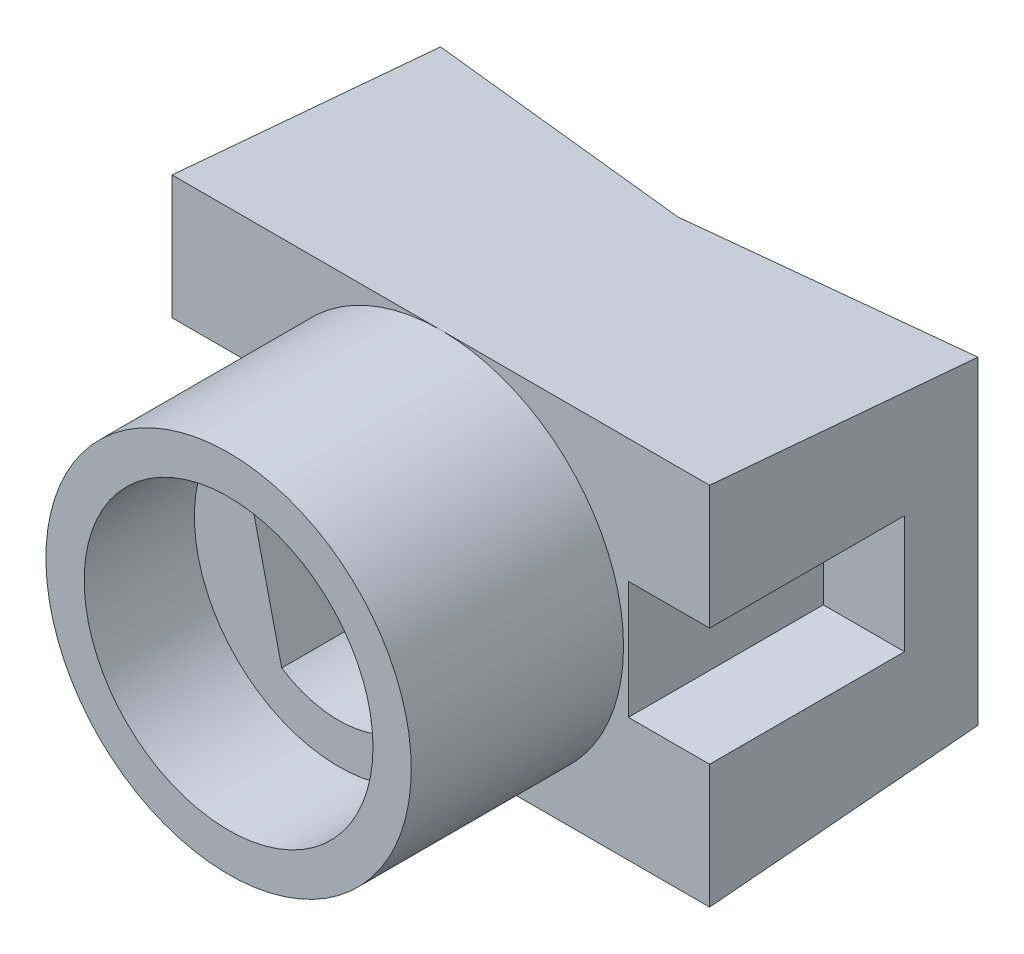
ISO-10303-21;
HEADER;
FILE_DESCRIPTION(('STEP AP214'),'2;1');
FILE_NAME('part.step','',(''),(''),'','','');
FILE_SCHEMA(('AUTOMOTIVE_DESIGN { 1 0 10303 214 1 1 1 1 }'));
ENDSEC;
DATA;
#1=APPLICATION_CONTEXT('core data for automotive mechanical design processes');
#2=APPLICATION_PROTOCOL_DEFINITION('international standard','automotive_design',2000,#1);
#3=PRODUCT_CONTEXT('',#1,'mechanical');
#4=PRODUCT('Part','Part','',(#3));
#5=PRODUCT_RELATED_PRODUCT_CATEGORY('part','',(#4));
#6=PRODUCT_DEFINITION_FORMATION('','',#4);
#7=PRODUCT_DEFINITION_CONTEXT('part definition',#1,'design');
#8=PRODUCT_DEFINITION('design','',#6,#7);
#9=PRODUCT_DEFINITION_SHAPE('','',#8);
#10=(LENGTH_UNIT() NAMED_UNIT(*) SI_UNIT(.MILLI.,.METRE.));
#11=(NAMED_UNIT(*) PLANE_ANGLE_UNIT() SI_UNIT($,.RADIAN.));
#12=(NAMED_UNIT(*) SI_UNIT($,.STERADIAN.) SOLID_ANGLE_UNIT());
#13=UNCERTAINTY_MEASURE_WITH_UNIT(LENGTH_MEASURE(1.E-05),#10,'distance_accuracy_value','');
#14=(GEOMETRIC_REPRESENTATION_CONTEXT(3) GLOBAL_UNCERTAINTY_ASSIGNED_CONTEXT((#13)) GLOBAL_UNIT_ASSIGNED_CONTEXT((#10,
#11,#12)) REPRESENTATION_CONTEXT('',''));
#15=CARTESIAN_POINT('',(0.,0.,0.));
#16=DIRECTION('',(0.,0.,1.));
#17=DIRECTION('',(1.,0.,0.));
#18=AXIS2_PLACEMENT_3D('',#15,#16,#17);
#19=CARTESIAN_POINT('',(0.,0.,4.4));
#20=DIRECTION('',(0.,0.,1.));
#21=DIRECTION('',(1.,0.,0.));
#22=AXIS2_PLACEMENT_3D('',#19,#20,#21);
#23=PLANE('',#22);
#24=CARTESIAN_POINT('',(0.,0.,4.4));
#25=DIRECTION('',(0.,0.,1.));
#26=DIRECTION('',(1.,0.,0.));
#27=AXIS2_PLACEMENT_3D('',#24,#25,#26);
#28=CIRCLE('',#27,6.225);
#29=CARTESIAN_POINT('',(6.22500000000001,0.,4.4));
#30=VERTEX_POINT('',#29);
#31=EDGE_CURVE('E328',#30,#30,#28,.T.);
#32=ORIENTED_EDGE('',*,*,#31,.T.);
#33=EDGE_LOOP('',(#32));
#34=FACE_BOUND('',#33,.T.);
#35=DIRECTION('',(-0.226618541803882,0.973983591499715,0.));
#36=VECTOR('',#35,1.);
#37=CARTESIAN_POINT('',(-3.8707911954993,2.29498922020236,4.4));
#38=LINE('',#37,#36);
#39=CARTESIAN_POINT('',(-2.46010214924883,-3.7680097419276,4.4));
#40=VERTEX_POINT('',#39);
#41=CARTESIAN_POINT('',(-3.8707911954993,2.29498922020236,4.39999999999999));
#42=VERTEX_POINT('',#41);
#43=EDGE_CURVE('E299',#40,#42,#38,.T.);
#44=ORIENTED_EDGE('',*,*,#43,.T.);
#45=CARTESIAN_POINT('',(0.,0.,4.4));
#46=DIRECTION('',(0.,0.,-1.));
#47=DIRECTION('',(-0.973983591499715,-0.226618541803882,0.));
#48=AXIS2_PLACEMENT_3D('',#45,#46,#47);
#49=CIRCLE('',#48,4.5);
#50=CARTESIAN_POINT('',(2.46010214924885,3.7680097419276,4.4));
#51=VERTEX_POINT('',#50);
#52=EDGE_CURVE('E315',#42,#51,#49,.T.);
#53=ORIENTED_EDGE('',*,*,#52,.T.);
#54=DIRECTION('',(0.226618541803882,-0.973983591499715,0.));
#55=VECTOR('',#54,1.);
#56=CARTESIAN_POINT('',(2.46010214924885,3.7680097419276,4.4));
#57=LINE('',#56,#55);
#58=CARTESIAN_POINT('',(3.87079119549931,-2.29498922020236,4.4));
#59=VERTEX_POINT('',#58);
#60=EDGE_CURVE('E310',#51,#59,#57,.T.);
#61=ORIENTED_EDGE('',*,*,#60,.T.);
#62=CARTESIAN_POINT('',(0.,0.,4.4));
#63=DIRECTION('',(0.,0.,-1.));
#64=DIRECTION('',(-0.973983591499715,-0.226618541803882,0.));
#65=AXIS2_PLACEMENT_3D('',#62,#63,#64);
#66=CIRCLE('',#65,4.5);
#67=EDGE_CURVE('E305',#59,#40,#66,.T.);
#68=ORIENTED_EDGE('',*,*,#67,.T.);
#69=EDGE_LOOP('',(#44,#53,#61,#68));
#70=FACE_BOUND('',#69,.T.);
#71=ADVANCED_FACE('F42',(#34,#70),#23,.T.);
#72=CARTESIAN_POINT('',(0.,0.,9.14999999999999));
#73=DIRECTION('',(0.,0.,-1.));
#74=DIRECTION('',(-1.,0.,0.));
#75=AXIS2_PLACEMENT_3D('',#72,#73,#74);
#76=CYLINDRICAL_SURFACE('',#75,7.875);
#77=CARTESIAN_POINT('',(0.,0.,9.14999999999999));
#78=DIRECTION('',(0.,0.,1.));
#79=DIRECTION('',(1.,0.,0.));
#80=AXIS2_PLACEMENT_3D('',#77,#78,#79);
#81=CIRCLE('',#80,7.875);
#82=CARTESIAN_POINT('',(7.875,0.,9.14999999999999));
#83=VERTEX_POINT('',#82);
#84=EDGE_CURVE('E429',#83,#83,#81,.T.);
#85=ORIENTED_EDGE('',*,*,#84,.F.);
#86=EDGE_LOOP('',(#85));
#87=FACE_BOUND('',#86,.T.);
#88=CARTESIAN_POINT('',(0.,0.,0.));
#89=DIRECTION('',(0.,0.,1.));
#90=DIRECTION('',(1.,0.,0.));
#91=AXIS2_PLACEMENT_3D('',#88,#89,#90);
#92=CIRCLE('',#91,7.875);
#93=CARTESIAN_POINT('',(0.046704711715459,-7.87486150163313,0.));
#94=VERTEX_POINT('',#93);
#95=CARTESIAN_POINT('',(0.0467047117159239,7.87486150163312,0.));
#96=VERTEX_POINT('',#95);
#97=EDGE_CURVE('E420',#94,#96,#92,.T.);
#98=ORIENTED_EDGE('',*,*,#97,.T.);
#99=CARTESIAN_POINT('',(0.,0.,-1.36704098327933));
#100=DIRECTION('',(0.,-0.171037543587131,0.985264512039117));
#101=DIRECTION('',(0.,-0.985264512039118,-0.171037543587131));
#102=AXIS2_PLACEMENT_3D('',#99,#100,#101);
#103=ELLIPSE('',#102,7.99277747627567,7.875);
#104=CARTESIAN_POINT('',(-0.046704711716021,7.87486150163313,0.));
#105=VERTEX_POINT('',#104);
#106=EDGE_CURVE('E241',#96,#105,#103,.T.);
#107=ORIENTED_EDGE('',*,*,#106,.T.);
#108=CARTESIAN_POINT('',(-0.0467047117154451,-7.87486150163313,0.));
#109=VERTEX_POINT('',#108);
#110=EDGE_CURVE('E434',#105,#109,#92,.T.);
#111=ORIENTED_EDGE('',*,*,#110,.T.);
#112=EDGE_CURVE('E439',#109,#94,#92,.T.);
#113=ORIENTED_EDGE('',*,*,#112,.T.);
#114=EDGE_LOOP('',(#98,#107,#111,#113));
#115=FACE_BOUND('',#114,.T.);
#116=ADVANCED_FACE('F44',(#87,#115),#76,.T.);
#117=CARTESIAN_POINT('',(0.,0.,9.14999999999999));
#118=DIRECTION('',(0.,0.,1.));
#119=DIRECTION('',(1.,0.,0.));
#120=AXIS2_PLACEMENT_3D('',#117,#118,#119);
#121=PLANE('',#120);
#122=CARTESIAN_POINT('',(0.,0.,9.14999999999999));
#123=DIRECTION('',(0.,0.,1.));
#124=DIRECTION('',(1.,0.,0.));
#125=AXIS2_PLACEMENT_3D('',#122,#123,#124);
#126=CIRCLE('',#125,6.225);
#127=CARTESIAN_POINT('',(6.22500000000001,0.,9.14999999999999));
#128=VERTEX_POINT('',#127);
#129=EDGE_CURVE('E303',#128,#128,#126,.T.);
#130=ORIENTED_EDGE('',*,*,#129,.F.);
#131=EDGE_LOOP('',(#130));
#132=FACE_BOUND('',#131,.T.);
#133=ORIENTED_EDGE('',*,*,#84,.T.);
#134=EDGE_LOOP('',(#133));
#135=FACE_BOUND('',#134,.T.);
#136=ADVANCED_FACE('F571',(#132,#135),#121,.T.);
#137=CARTESIAN_POINT('',(0.,0.,0.));
#138=DIRECTION('',(0.,0.,-1.));
#139=DIRECTION('',(-1.,0.,0.));
#140=AXIS2_PLACEMENT_3D('',#137,#138,#139);
#141=PLANE('',#140);
#142=ORIENTED_EDGE('',*,*,#110,.F.);
#143=DIRECTION('',(-1.,0.,0.));
#144=VECTOR('',#143,1.);
#145=CARTESIAN_POINT('',(11.585025,7.87486150163313,0.));
#146=LINE('',#145,#144);
#147=CARTESIAN_POINT('',(-11.585,7.87486150163313,0.));
#148=VERTEX_POINT('',#147);
#149=EDGE_CURVE('E227',#105,#148,#146,.T.);
#150=ORIENTED_EDGE('',*,*,#149,.T.);
#151=DIRECTION('',(0.,-1.,0.));
#152=VECTOR('',#151,1.);
#153=CARTESIAN_POINT('',(-11.585,0.,0.));
#154=LINE('',#153,#152);
#155=CARTESIAN_POINT('',(-11.585,2.54,0.));
#156=VERTEX_POINT('',#155);
#157=EDGE_CURVE('E417',#148,#156,#154,.T.);
#158=ORIENTED_EDGE('',*,*,#157,.T.);
#159=DIRECTION('',(-1.,0.,0.));
#160=VECTOR('',#159,1.);
#161=CARTESIAN_POINT('',(-8.085,2.54,0.));
#162=LINE('',#161,#160);
#163=CARTESIAN_POINT('',(-8.085,2.54,0.));
#164=VERTEX_POINT('',#163);
#165=EDGE_CURVE('E404',#164,#156,#162,.T.);
#166=ORIENTED_EDGE('',*,*,#165,.F.);
#167=DIRECTION('',(0.,1.,0.));
#168=VECTOR('',#167,1.);
#169=CARTESIAN_POINT('',(-8.085,2.54,0.));
#170=LINE('',#169,#168);
#171=CARTESIAN_POINT('',(-8.085,-2.54,0.));
#172=VERTEX_POINT('',#171);
#173=EDGE_CURVE('E384',#172,#164,#170,.T.);
#174=ORIENTED_EDGE('',*,*,#173,.F.);
#175=DIRECTION('',(-1.,0.,0.));
#176=VECTOR('',#175,1.);
#177=CARTESIAN_POINT('',(-8.085,-2.54,0.));
#178=LINE('',#177,#176);
#179=CARTESIAN_POINT('',(-11.585,-2.54,0.));
#180=VERTEX_POINT('',#179);
#181=EDGE_CURVE('E407',#172,#180,#178,.T.);
#182=ORIENTED_EDGE('',*,*,#181,.T.);
#183=CARTESIAN_POINT('',(-11.585,-7.87486150163313,0.));
#184=VERTEX_POINT('',#183);
#185=EDGE_CURVE('E425',#180,#184,#154,.T.);
#186=ORIENTED_EDGE('',*,*,#185,.T.);
#187=DIRECTION('',(-1.,0.,0.));
#188=VECTOR('',#187,1.);
#189=CARTESIAN_POINT('',(11.585025,-7.87486150163313,0.));
#190=LINE('',#189,#188);
#191=EDGE_CURVE('E221',#109,#184,#190,.T.);
#192=ORIENTED_EDGE('',*,*,#191,.F.);
#193=EDGE_LOOP('',(#142,#150,#158,#166,#174,#182,#186,#192));
#194=FACE_BOUND('',#193,.T.);
#195=ADVANCED_FACE('F550',(#194),#141,.F.);
#196=CARTESIAN_POINT('',(11.585,0.,-11.57));
#197=DIRECTION('',(-1.,0.,0.));
#198=DIRECTION('',(0.,-1.,0.));
#199=AXIS2_PLACEMENT_3D('',#196,#197,#198);
#200=PLANE('',#199);
#201=DIRECTION('',(0.,-1.,0.));
#202=VECTOR('',#201,1.);
#203=CARTESIAN_POINT('',(11.585,0.,-11.57));
#204=LINE('',#203,#202);
#205=CARTESIAN_POINT('',(11.585,6.8707,-11.57));
#206=VERTEX_POINT('',#205);
#207=CARTESIAN_POINT('',(11.585,-6.87070000000001,-11.57));
#208=VERTEX_POINT('',#207);
#209=EDGE_CURVE('E200',#206,#208,#204,.T.);
#210=ORIENTED_EDGE('',*,*,#209,.F.);
#211=DIRECTION('',(0.,0.0864650647934085,0.996254883335721));
#212=VECTOR('',#211,1.);
#213=CARTESIAN_POINT('',(11.585,6.81933322161256,-12.1618506385438));
#214=LINE('',#213,#212);
#215=CARTESIAN_POINT('',(11.585000000482,7.87486150163313,0.));
#216=VERTEX_POINT('',#215);
#217=EDGE_CURVE('E237',#206,#216,#214,.T.);
#218=ORIENTED_EDGE('',*,*,#217,.T.);
#219=DIRECTION('',(0.,-1.,0.));
#220=VECTOR('',#219,1.);
#221=CARTESIAN_POINT('',(11.585,0.,0.));
#222=LINE('',#221,#220);
#223=CARTESIAN_POINT('',(11.585,2.54,0.));
#224=VERTEX_POINT('',#223);
#225=EDGE_CURVE('E421',#216,#224,#222,.T.);
#226=ORIENTED_EDGE('',*,*,#225,.T.);
#227=DIRECTION('',(0.,0.,1.));
#228=VECTOR('',#227,1.);
#229=CARTESIAN_POINT('',(11.585,2.54,0.));
#230=LINE('',#229,#228);
#231=CARTESIAN_POINT('',(11.585,2.54,-8.4));
#232=VERTEX_POINT('',#231);
#233=EDGE_CURVE('E341',#232,#224,#230,.T.);
#234=ORIENTED_EDGE('',*,*,#233,.F.);
#235=DIRECTION('',(0.,1.,0.));
#236=VECTOR('',#235,1.);
#237=CARTESIAN_POINT('',(11.585,2.54,-8.4));
#238=LINE('',#237,#236);
#239=CARTESIAN_POINT('',(11.585,-2.54,-8.4));
#240=VERTEX_POINT('',#239);
#241=EDGE_CURVE('E356',#240,#232,#238,.T.);
#242=ORIENTED_EDGE('',*,*,#241,.F.);
#243=DIRECTION('',(0.,0.,-1.));
#244=VECTOR('',#243,1.);
#245=CARTESIAN_POINT('',(11.585,-2.54,0.));
#246=LINE('',#245,#244);
#247=CARTESIAN_POINT('',(11.585,-2.54,0.));
#248=VERTEX_POINT('',#247);
#249=EDGE_CURVE('E332',#248,#240,#246,.T.);
#250=ORIENTED_EDGE('',*,*,#249,.F.);
#251=CARTESIAN_POINT('',(11.585,-7.87486150163313,0.));
#252=VERTEX_POINT('',#251);
#253=EDGE_CURVE('E403',#248,#252,#222,.T.);
#254=ORIENTED_EDGE('',*,*,#253,.T.);
#255=DIRECTION('',(0.,0.0864650647934084,-0.996254883335721));
#256=VECTOR('',#255,1.);
#257=CARTESIAN_POINT('',(11.585,-6.81933322161258,-12.1618506385438));
#258=LINE('',#257,#256);
#259=EDGE_CURVE('E234',#252,#208,#258,.T.);
#260=ORIENTED_EDGE('',*,*,#259,.T.);
#261=EDGE_LOOP('',(#210,#218,#226,#234,#242,#250,#254,#260));
#262=FACE_BOUND('',#261,.T.);
#263=ADVANCED_FACE('F458',(#262),#200,.F.);
#264=CARTESIAN_POINT('',(-11.585,0.,-11.57));
#265=DIRECTION('',(-1.,0.,0.));
#266=DIRECTION('',(0.,-1.,0.));
#267=AXIS2_PLACEMENT_3D('',#264,#265,#266);
#268=PLANE('',#267);
#269=DIRECTION('',(0.,0.0864650647934085,0.996254883335721));
#270=VECTOR('',#269,1.);
#271=CARTESIAN_POINT('',(-11.585,7.87486150163313,0.));
#272=LINE('',#271,#270);
#273=CARTESIAN_POINT('',(-11.585,6.8707,-11.57));
#274=VERTEX_POINT('',#273);
#275=EDGE_CURVE('E224',#274,#148,#272,.T.);
#276=ORIENTED_EDGE('',*,*,#275,.F.);
#277=DIRECTION('',(0.,-1.,0.));
#278=VECTOR('',#277,1.);
#279=CARTESIAN_POINT('',(-11.585,0.,-11.57));
#280=LINE('',#279,#278);
#281=CARTESIAN_POINT('',(-11.585,-6.8707,-11.57));
#282=VERTEX_POINT('',#281);
#283=EDGE_CURVE('E416',#274,#282,#280,.T.);
#284=ORIENTED_EDGE('',*,*,#283,.T.);
#285=DIRECTION('',(0.,0.0864650647934084,-0.996254883335721));
#286=VECTOR('',#285,1.);
#287=CARTESIAN_POINT('',(-11.585,-7.87486150163313,0.));
#288=LINE('',#287,#286);
#289=EDGE_CURVE('E215',#184,#282,#288,.T.);
#290=ORIENTED_EDGE('',*,*,#289,.F.);
#291=ORIENTED_EDGE('',*,*,#185,.F.);
#292=DIRECTION('',(0.,0.,1.));
#293=VECTOR('',#292,1.);
#294=CARTESIAN_POINT('',(-11.585,-2.54,-8.4));
#295=LINE('',#294,#293);
#296=CARTESIAN_POINT('',(-11.585,-2.54,-8.4));
#297=VERTEX_POINT('',#296);
#298=EDGE_CURVE('E394',#297,#180,#295,.T.);
#299=ORIENTED_EDGE('',*,*,#298,.F.);
#300=DIRECTION('',(0.,-1.,0.));
#301=VECTOR('',#300,1.);
#302=CARTESIAN_POINT('',(-11.585,2.54,-8.4));
#303=LINE('',#302,#301);
#304=CARTESIAN_POINT('',(-11.585,2.54,-8.4));
#305=VERTEX_POINT('',#304);
#306=EDGE_CURVE('E366',#305,#297,#303,.T.);
#307=ORIENTED_EDGE('',*,*,#306,.F.);
#308=DIRECTION('',(0.,0.,-1.));
#309=VECTOR('',#308,1.);
#310=CARTESIAN_POINT('',(-11.585,2.54,-8.4));
#311=LINE('',#310,#309);
#312=EDGE_CURVE('E380',#156,#305,#311,.T.);
#313=ORIENTED_EDGE('',*,*,#312,.F.);
#314=ORIENTED_EDGE('',*,*,#157,.F.);
#315=EDGE_LOOP('',(#276,#284,#290,#291,#299,#307,#313,#314));
#316=FACE_BOUND('',#315,.T.);
#317=ADVANCED_FACE('F617',(#316),#268,.T.);
#318=ORIENTED_EDGE('',*,*,#225,.F.);
#319=DIRECTION('',(-1.,0.,0.));
#320=VECTOR('',#319,1.);
#321=CARTESIAN_POINT('',(0.,7.87486150163312,0.));
#322=LINE('',#321,#320);
#323=EDGE_CURVE('E446',#216,#96,#322,.T.);
#324=ORIENTED_EDGE('',*,*,#323,.T.);
#325=ORIENTED_EDGE('',*,*,#97,.F.);
#326=DIRECTION('',(1.,0.,0.));
#327=VECTOR('',#326,1.);
#328=CARTESIAN_POINT('',(0.,-7.87486150163313,0.));
#329=LINE('',#328,#327);
#330=EDGE_CURVE('E433',#94,#252,#329,.T.);
#331=ORIENTED_EDGE('',*,*,#330,.T.);
#332=ORIENTED_EDGE('',*,*,#253,.F.);
#333=DIRECTION('',(1.,0.,0.));
#334=VECTOR('',#333,1.);
#335=CARTESIAN_POINT('',(8.08500000000001,-2.54,0.));
#336=LINE('',#335,#334);
#337=CARTESIAN_POINT('',(8.08500000000001,-2.54,0.));
#338=VERTEX_POINT('',#337);
#339=EDGE_CURVE('E352',#338,#248,#336,.T.);
#340=ORIENTED_EDGE('',*,*,#339,.F.);
#341=DIRECTION('',(0.,-1.,0.));
#342=VECTOR('',#341,1.);
#343=CARTESIAN_POINT('',(8.08500000000001,2.54,0.));
#344=LINE('',#343,#342);
#345=CARTESIAN_POINT('',(8.08500000000001,2.54,0.));
#346=VERTEX_POINT('',#345);
#347=EDGE_CURVE('E336',#346,#338,#344,.T.);
#348=ORIENTED_EDGE('',*,*,#347,.F.);
#349=DIRECTION('',(1.,0.,0.));
#350=VECTOR('',#349,1.);
#351=CARTESIAN_POINT('',(8.08500000000001,2.54,0.));
#352=LINE('',#351,#350);
#353=EDGE_CURVE('E362',#346,#224,#352,.T.);
#354=ORIENTED_EDGE('',*,*,#353,.T.);
#355=EDGE_LOOP('',(#318,#324,#325,#331,#332,#340,#348,#354));
#356=FACE_BOUND('',#355,.T.);
#357=ADVANCED_FACE('F467',(#356),#141,.F.);
#358=CARTESIAN_POINT('',(-8.085,2.54,-8.4));
#359=DIRECTION('',(0.,0.,-1.));
#360=DIRECTION('',(-1.,0.,0.));
#361=AXIS2_PLACEMENT_3D('',#358,#359,#360);
#362=PLANE('',#361);
#363=ORIENTED_EDGE('',*,*,#306,.T.);
#364=DIRECTION('',(-1.,0.,0.));
#365=VECTOR('',#364,1.);
#366=CARTESIAN_POINT('',(-8.085,-2.54,-8.4));
#367=LINE('',#366,#365);
#368=CARTESIAN_POINT('',(-8.085,-2.54,-8.4));
#369=VERTEX_POINT('',#368);
#370=EDGE_CURVE('E391',#369,#297,#367,.T.);
#371=ORIENTED_EDGE('',*,*,#370,.F.);
#372=DIRECTION('',(0.,-1.,0.));
#373=VECTOR('',#372,1.);
#374=CARTESIAN_POINT('',(-8.085,2.54,-8.4));
#375=LINE('',#374,#373);
#376=CARTESIAN_POINT('',(-8.085,2.54,-8.4));
#377=VERTEX_POINT('',#376);
#378=EDGE_CURVE('E375',#377,#369,#375,.T.);
#379=ORIENTED_EDGE('',*,*,#378,.F.);
#380=DIRECTION('',(-1.,0.,0.));
#381=VECTOR('',#380,1.);
#382=CARTESIAN_POINT('',(-8.085,2.54,-8.4));
#383=LINE('',#382,#381);
#384=EDGE_CURVE('E400',#377,#305,#383,.T.);
#385=ORIENTED_EDGE('',*,*,#384,.T.);
#386=EDGE_LOOP('',(#363,#371,#379,#385));
#387=FACE_BOUND('',#386,.T.);
#388=ADVANCED_FACE('F607',(#387),#362,.F.);
#389=CARTESIAN_POINT('',(-8.085,2.54,-8.4));
#390=DIRECTION('',(0.,1.,0.));
#391=DIRECTION('',(-1.,0.,0.));
#392=AXIS2_PLACEMENT_3D('',#389,#390,#391);
#393=PLANE('',#392);
#394=ORIENTED_EDGE('',*,*,#312,.T.);
#395=ORIENTED_EDGE('',*,*,#384,.F.);
#396=DIRECTION('',(0.,0.,-1.));
#397=VECTOR('',#396,1.);
#398=CARTESIAN_POINT('',(-8.085,2.54,-8.4));
#399=LINE('',#398,#397);
#400=EDGE_CURVE('E387',#164,#377,#399,.T.);
#401=ORIENTED_EDGE('',*,*,#400,.F.);
#402=ORIENTED_EDGE('',*,*,#165,.T.);
#403=EDGE_LOOP('',(#394,#395,#401,#402));
#404=FACE_BOUND('',#403,.T.);
#405=ADVANCED_FACE('F604',(#404),#393,.F.);
#406=CARTESIAN_POINT('',(-8.085,-2.54,-8.4));
#407=DIRECTION('',(0.,-1.,0.));
#408=DIRECTION('',(1.,0.,0.));
#409=AXIS2_PLACEMENT_3D('',#406,#407,#408);
#410=PLANE('',#409);
#411=ORIENTED_EDGE('',*,*,#298,.T.);
#412=ORIENTED_EDGE('',*,*,#181,.F.);
#413=DIRECTION('',(0.,0.,1.));
#414=VECTOR('',#413,1.);
#415=CARTESIAN_POINT('',(-8.085,-2.54,-8.4));
#416=LINE('',#415,#414);
#417=EDGE_CURVE('E379',#369,#172,#416,.T.);
#418=ORIENTED_EDGE('',*,*,#417,.F.);
#419=ORIENTED_EDGE('',*,*,#370,.T.);
#420=EDGE_LOOP('',(#411,#412,#418,#419));
#421=FACE_BOUND('',#420,.T.);
#422=ADVANCED_FACE('F602',(#421),#410,.F.);
#423=CARTESIAN_POINT('',(-8.085,0.,0.));
#424=DIRECTION('',(-1.,0.,0.));
#425=DIRECTION('',(0.,0.,1.));
#426=AXIS2_PLACEMENT_3D('',#423,#424,#425);
#427=PLANE('',#426);
#428=ORIENTED_EDGE('',*,*,#378,.T.);
#429=ORIENTED_EDGE('',*,*,#417,.T.);
#430=ORIENTED_EDGE('',*,*,#173,.T.);
#431=ORIENTED_EDGE('',*,*,#400,.T.);
#432=EDGE_LOOP('',(#428,#429,#430,#431));
#433=FACE_BOUND('',#432,.T.);
#434=ADVANCED_FACE('F592',(#433),#427,.T.);
#435=CARTESIAN_POINT('',(8.08500000000001,2.54,0.));
#436=DIRECTION('',(0.,1.,0.));
#437=DIRECTION('',(-1.,0.,0.));
#438=AXIS2_PLACEMENT_3D('',#435,#436,#437);
#439=PLANE('',#438);
#440=ORIENTED_EDGE('',*,*,#233,.T.);
#441=ORIENTED_EDGE('',*,*,#353,.F.);
#442=DIRECTION('',(0.,0.,1.));
#443=VECTOR('',#442,1.);
#444=CARTESIAN_POINT('',(8.08500000000001,2.54,0.));
#445=LINE('',#444,#443);
#446=CARTESIAN_POINT('',(8.085,2.54,-8.4));
#447=VERTEX_POINT('',#446);
#448=EDGE_CURVE('E349',#447,#346,#445,.T.);
#449=ORIENTED_EDGE('',*,*,#448,.F.);
#450=DIRECTION('',(1.,0.,0.));
#451=VECTOR('',#450,1.);
#452=CARTESIAN_POINT('',(8.085,2.54,-8.4));
#453=LINE('',#452,#451);
#454=EDGE_CURVE('E367',#447,#232,#453,.T.);
#455=ORIENTED_EDGE('',*,*,#454,.T.);
#456=EDGE_LOOP('',(#440,#441,#449,#455));
#457=FACE_BOUND('',#456,.T.);
#458=ADVANCED_FACE('F588',(#457),#439,.F.);
#459=CARTESIAN_POINT('',(8.085,2.54,-8.4));
#460=DIRECTION('',(0.,0.,-1.));
#461=DIRECTION('',(0.,1.,0.));
#462=AXIS2_PLACEMENT_3D('',#459,#460,#461);
#463=PLANE('',#462);
#464=ORIENTED_EDGE('',*,*,#241,.T.);
#465=ORIENTED_EDGE('',*,*,#454,.F.);
#466=DIRECTION('',(0.,1.,0.));
#467=VECTOR('',#466,1.);
#468=CARTESIAN_POINT('',(8.085,2.54,-8.4));
#469=LINE('',#468,#467);
#470=CARTESIAN_POINT('',(8.08500000000001,-2.54,-8.4));
#471=VERTEX_POINT('',#470);
#472=EDGE_CURVE('E345',#471,#447,#469,.T.);
#473=ORIENTED_EDGE('',*,*,#472,.F.);
#474=DIRECTION('',(1.,0.,0.));
#475=VECTOR('',#474,1.);
#476=CARTESIAN_POINT('',(8.08500000000001,-2.54,-8.4));
#477=LINE('',#476,#475);
#478=EDGE_CURVE('E370',#471,#240,#477,.T.);
#479=ORIENTED_EDGE('',*,*,#478,.T.);
#480=EDGE_LOOP('',(#464,#465,#473,#479));
#481=FACE_BOUND('',#480,.T.);
#482=ADVANCED_FACE('F591',(#481),#463,.F.);
#483=CARTESIAN_POINT('',(8.08500000000001,-2.54,0.));
#484=DIRECTION('',(0.,-1.,0.));
#485=DIRECTION('',(1.,0.,0.));
#486=AXIS2_PLACEMENT_3D('',#483,#484,#485);
#487=PLANE('',#486);
#488=ORIENTED_EDGE('',*,*,#249,.T.);
#489=ORIENTED_EDGE('',*,*,#478,.F.);
#490=DIRECTION('',(0.,0.,-1.));
#491=VECTOR('',#490,1.);
#492=CARTESIAN_POINT('',(8.08500000000001,-2.54,0.));
#493=LINE('',#492,#491);
#494=EDGE_CURVE('E340',#338,#471,#493,.T.);
#495=ORIENTED_EDGE('',*,*,#494,.F.);
#496=ORIENTED_EDGE('',*,*,#339,.T.);
#497=EDGE_LOOP('',(#488,#489,#495,#496));
#498=FACE_BOUND('',#497,.T.);
#499=ADVANCED_FACE('F586',(#498),#487,.F.);
#500=CARTESIAN_POINT('',(8.08500000000001,0.,0.));
#501=DIRECTION('',(1.,0.,0.));
#502=DIRECTION('',(0.,0.,-1.));
#503=AXIS2_PLACEMENT_3D('',#500,#501,#502);
#504=PLANE('',#503);
#505=ORIENTED_EDGE('',*,*,#347,.T.);
#506=ORIENTED_EDGE('',*,*,#494,.T.);
#507=ORIENTED_EDGE('',*,*,#472,.T.);
#508=ORIENTED_EDGE('',*,*,#448,.T.);
#509=EDGE_LOOP('',(#505,#506,#507,#508));
#510=FACE_BOUND('',#509,.T.);
#511=ADVANCED_FACE('F582',(#510),#504,.T.);
#512=CARTESIAN_POINT('',(0.,0.,4.4));
#513=DIRECTION('',(0.,0.,1.));
#514=DIRECTION('',(1.,0.,0.));
#515=AXIS2_PLACEMENT_3D('',#512,#513,#514);
#516=CYLINDRICAL_SURFACE('',#515,6.225);
#517=CARTESIAN_POINT('',(6.22500000000001,0.,4.4));
#518=CARTESIAN_POINT('',(6.22500000000001,0.,4.44947916666667));
#519=CARTESIAN_POINT('',(6.22500000000001,0.,4.49895833333333));
#520=CARTESIAN_POINT('',(6.22500000000001,0.,4.59791666666667));
#521=CARTESIAN_POINT('',(6.22500000000001,0.,4.64739583333333));
#522=CARTESIAN_POINT('',(6.22500000000001,0.,4.74635416666667));
#523=CARTESIAN_POINT('',(6.22500000000001,0.,4.79583333333333));
#524=CARTESIAN_POINT('',(6.22500000000001,0.,4.89479166666667));
#525=CARTESIAN_POINT('',(6.22500000000001,0.,4.94427083333333));
#526=CARTESIAN_POINT('',(6.22500000000001,0.,5.04322916666667));
#527=CARTESIAN_POINT('',(6.22500000000001,0.,5.09270833333333));
#528=CARTESIAN_POINT('',(6.22500000000001,0.,5.19166666666667));
#529=CARTESIAN_POINT('',(6.22500000000001,0.,5.24114583333333));
#530=CARTESIAN_POINT('',(6.22500000000001,0.,5.34010416666666));
#531=CARTESIAN_POINT('',(6.22500000000001,0.,5.38958333333333));
#532=CARTESIAN_POINT('',(6.22500000000001,0.,5.48854166666666));
#533=CARTESIAN_POINT('',(6.22500000000001,0.,5.53802083333333));
#534=CARTESIAN_POINT('',(6.22500000000001,0.,5.63697916666667));
#535=CARTESIAN_POINT('',(6.22500000000001,0.,5.68645833333333));
#536=CARTESIAN_POINT('',(6.22500000000001,0.,5.78541666666666));
#537=CARTESIAN_POINT('',(6.22500000000001,0.,5.83489583333333));
#538=CARTESIAN_POINT('',(6.22500000000001,0.,5.93385416666666));
#539=CARTESIAN_POINT('',(6.22500000000001,0.,5.98333333333333));
#540=CARTESIAN_POINT('',(6.22500000000001,0.,6.08229166666666));
#541=CARTESIAN_POINT('',(6.22500000000001,0.,6.13177083333333));
#542=CARTESIAN_POINT('',(6.22500000000001,0.,6.23072916666666));
#543=CARTESIAN_POINT('',(6.22500000000001,0.,6.28020833333333));
#544=CARTESIAN_POINT('',(6.22500000000001,0.,6.37916666666666));
#545=CARTESIAN_POINT('',(6.22500000000001,0.,6.42864583333333));
#546=CARTESIAN_POINT('',(6.22500000000001,0.,6.52760416666666));
#547=CARTESIAN_POINT('',(6.22500000000001,0.,6.57708333333333));
#548=CARTESIAN_POINT('',(6.22500000000001,0.,6.67604166666666));
#549=CARTESIAN_POINT('',(6.22500000000001,0.,6.72552083333333));
#550=CARTESIAN_POINT('',(6.22500000000001,0.,6.82447916666666));
#551=CARTESIAN_POINT('',(6.22500000000001,0.,6.87395833333333));
#552=CARTESIAN_POINT('',(6.22500000000001,0.,6.97291666666666));
#553=CARTESIAN_POINT('',(6.22500000000001,0.,7.02239583333333));
#554=CARTESIAN_POINT('',(6.22500000000001,0.,7.12135416666666));
#555=CARTESIAN_POINT('',(6.22500000000001,0.,7.17083333333333));
#556=CARTESIAN_POINT('',(6.22500000000001,0.,7.26979166666666));
#557=CARTESIAN_POINT('',(6.22500000000001,0.,7.31927083333333));
#558=CARTESIAN_POINT('',(6.22500000000001,0.,7.41822916666666));
#559=CARTESIAN_POINT('',(6.22500000000001,0.,7.46770833333333));
#560=CARTESIAN_POINT('',(6.22500000000001,0.,7.56666666666666));
#561=CARTESIAN_POINT('',(6.22500000000001,0.,7.61614583333333));
#562=CARTESIAN_POINT('',(6.22500000000001,0.,7.71510416666666));
#563=CARTESIAN_POINT('',(6.22500000000001,0.,7.76458333333333));
#564=CARTESIAN_POINT('',(6.22500000000001,0.,7.86354166666666));
#565=CARTESIAN_POINT('',(6.22500000000001,0.,7.91302083333333));
#566=CARTESIAN_POINT('',(6.22500000000001,0.,8.01197916666666));
#567=CARTESIAN_POINT('',(6.22500000000001,0.,8.06145833333333));
#568=CARTESIAN_POINT('',(6.22500000000001,0.,8.16041666666666));
#569=CARTESIAN_POINT('',(6.22500000000001,0.,8.20989583333333));
#570=CARTESIAN_POINT('',(6.22500000000001,0.,8.30885416666666));
#571=CARTESIAN_POINT('',(6.22500000000001,0.,8.35833333333333));
#572=CARTESIAN_POINT('',(6.22500000000001,0.,8.45729166666666));
#573=CARTESIAN_POINT('',(6.22500000000001,0.,8.50677083333333));
#574=CARTESIAN_POINT('',(6.22500000000001,0.,8.60572916666666));
#575=CARTESIAN_POINT('',(6.22500000000001,0.,8.65520833333333));
#576=CARTESIAN_POINT('',(6.22500000000001,0.,8.75416666666666));
#577=CARTESIAN_POINT('',(6.22500000000001,0.,8.80364583333333));
#578=CARTESIAN_POINT('',(6.22500000000001,0.,8.90260416666666));
#579=CARTESIAN_POINT('',(6.22500000000001,0.,8.95208333333332));
#580=CARTESIAN_POINT('',(6.22500000000001,0.,9.05104166666666));
#581=CARTESIAN_POINT('',(6.22500000000001,0.,9.10052083333333));
#582=CARTESIAN_POINT('',(6.22500000000001,0.,9.14999999999999));
#583=B_SPLINE_CURVE_WITH_KNOTS('',3,(#517,#518,#519,#520,#521,#522,#523,#524,#525,#526,#527,
#528,#529,#530,#531,#532,#533,#534,#535,#536,#537,#538,#539,#540,#541,#542,#543,#544,#545,#546,
#547,#548,#549,#550,#551,#552,#553,#554,#555,#556,#557,#558,#559,#560,#561,#562,#563,#564,#565,
#566,#567,#568,#569,#570,#571,#572,#573,#574,#575,#576,#577,#578,#579,#580,#581,#582),
.UNSPECIFIED.,.F.,.F.,(4,2,2,2,2,2,2,2,2,2,2,2,2,2,2,2,2,2,2,2,2,2,2,2,2,2,2,2,2,2,2,2,4),(0.,
0.1484375,0.296874999999999,0.4453125,0.59375,0.742187499999999,0.890624999999998,1.0390625,
1.1875,1.3359375,1.484375,1.6328125,1.78125,1.9296875,2.078125,2.2265625,2.375,2.5234375,
2.67187499999999,2.82031249999999,2.96874999999999,3.11718749999999,3.26562499999999,
3.41406249999999,3.56249999999999,3.71093749999999,3.85937499999999,4.00781249999999,
4.15624999999999,4.30468749999999,4.45312499999999,4.60156249999999,4.74999999999999),.UNSPECIFIED.);
#584=EDGE_CURVE('BSEAM578',#30,#128,#583,.T.);
#585=ORIENTED_EDGE('',*,*,#31,.F.);
#586=ORIENTED_EDGE('',*,*,#129,.T.);
#587=ORIENTED_EDGE('',*,*,#584,.T.);
#588=ORIENTED_EDGE('',*,*,#584,.F.);
#589=EDGE_LOOP('',(#585,#587,#586,#588));
#590=FACE_BOUND('',#589,.T.);
#591=ADVANCED_FACE('F578',(#590),#516,.F.);
#592=CARTESIAN_POINT('',(0.,0.,-49.4018016555872));
#593=DIRECTION('',(0.,0.,1.));
#594=DIRECTION('',(0.973983591499715,0.226618541803882,0.));
#595=AXIS2_PLACEMENT_3D('',#592,#593,#594);
#596=CYLINDRICAL_SURFACE('',#595,4.5);
#597=CARTESIAN_POINT('',(0.,0.,-7.89999999999999));
#598=DIRECTION('',(0.,0.,-1.));
#599=DIRECTION('',(-0.973983591499715,-0.226618541803882,0.));
#600=AXIS2_PLACEMENT_3D('',#597,#598,#599);
#601=CIRCLE('',#600,4.5);
#602=CARTESIAN_POINT('',(-3.8707911954993,2.29498922020236,-7.9));
#603=VERTEX_POINT('',#602);
#604=CARTESIAN_POINT('',(2.46010214924884,3.76800974192759,-7.89999999999999));
#605=VERTEX_POINT('',#604);
#606=EDGE_CURVE('E245',#603,#605,#601,.T.);
#607=ORIENTED_EDGE('',*,*,#606,.T.);
#608=DIRECTION('',(0.,0.,1.));
#609=VECTOR('',#608,1.);
#610=CARTESIAN_POINT('',(2.46010214924886,3.7680097419276,-49.4018016555872));
#611=LINE('',#610,#609);
#612=EDGE_CURVE('E314',#605,#51,#611,.T.);
#613=ORIENTED_EDGE('',*,*,#612,.T.);
#614=ORIENTED_EDGE('',*,*,#52,.F.);
#615=DIRECTION('',(0.,0.,1.));
#616=VECTOR('',#615,1.);
#617=CARTESIAN_POINT('',(-3.8707911954993,2.29498922020236,-49.4018016555872));
#618=LINE('',#617,#616);
#619=EDGE_CURVE('E289',#603,#42,#618,.T.);
#620=ORIENTED_EDGE('',*,*,#619,.F.);
#621=EDGE_LOOP('',(#607,#613,#614,#620));
#622=FACE_BOUND('',#621,.T.);
#623=ADVANCED_FACE('F581',(#622),#596,.F.);
#624=CARTESIAN_POINT('',(2.46010214924886,3.7680097419276,-49.4018016555872));
#625=DIRECTION('',(-0.973983591499715,-0.226618541803882,0.));
#626=DIRECTION('',(0.,0.,1.));
#627=AXIS2_PLACEMENT_3D('',#624,#625,#626);
#628=PLANE('',#627);
#629=DIRECTION('',(0.226618541803882,-0.973983591499715,0.));
#630=VECTOR('',#629,1.);
#631=CARTESIAN_POINT('',(3.16544667237408,0.736510260862615,-7.89999999999999));
#632=LINE('',#631,#630);
#633=CARTESIAN_POINT('',(3.87079119549931,-2.29498922020236,-7.9));
#634=VERTEX_POINT('',#633);
#635=EDGE_CURVE('E249',#605,#634,#632,.T.);
#636=ORIENTED_EDGE('',*,*,#635,.T.);
#637=DIRECTION('',(0.,0.,1.));
#638=VECTOR('',#637,1.);
#639=CARTESIAN_POINT('',(3.87079119549932,-2.29498922020237,-49.4018016555872));
#640=LINE('',#639,#638);
#641=EDGE_CURVE('E309',#634,#59,#640,.T.);
#642=ORIENTED_EDGE('',*,*,#641,.T.);
#643=ORIENTED_EDGE('',*,*,#60,.F.);
#644=ORIENTED_EDGE('',*,*,#612,.F.);
#645=EDGE_LOOP('',(#636,#642,#643,#644));
#646=FACE_BOUND('',#645,.T.);
#647=ADVANCED_FACE('F688',(#646),#628,.T.);
#648=CARTESIAN_POINT('',(0.,0.,-49.4018016555872));
#649=DIRECTION('',(0.,0.,1.));
#650=DIRECTION('',(0.973983591499715,0.226618541803882,0.));
#651=AXIS2_PLACEMENT_3D('',#648,#649,#650);
#652=CYLINDRICAL_SURFACE('',#651,4.5);
#653=CARTESIAN_POINT('',(0.,0.,-7.89999999999999));
#654=DIRECTION('',(0.,0.,-1.));
#655=DIRECTION('',(-0.973983591499715,-0.226618541803882,0.));
#656=AXIS2_PLACEMENT_3D('',#653,#654,#655);
#657=CIRCLE('',#656,4.5);
#658=CARTESIAN_POINT('',(-2.46010214924883,-3.7680097419276,-7.9));
#659=VERTEX_POINT('',#658);
#660=EDGE_CURVE('E252',#634,#659,#657,.T.);
#661=ORIENTED_EDGE('',*,*,#660,.T.);
#662=DIRECTION('',(0.,0.,1.));
#663=VECTOR('',#662,1.);
#664=CARTESIAN_POINT('',(-2.46010214924883,-3.7680097419276,-49.4018016555872));
#665=LINE('',#664,#663);
#666=EDGE_CURVE('E304',#659,#40,#665,.T.);
#667=ORIENTED_EDGE('',*,*,#666,.T.);
#668=ORIENTED_EDGE('',*,*,#67,.F.);
#669=ORIENTED_EDGE('',*,*,#641,.F.);
#670=EDGE_LOOP('',(#661,#667,#668,#669));
#671=FACE_BOUND('',#670,.T.);
#672=ADVANCED_FACE('F695',(#671),#652,.F.);
#673=CARTESIAN_POINT('',(-3.8707911954993,2.29498922020236,-49.4018016555872));
#674=DIRECTION('',(0.973983591499715,0.226618541803882,0.));
#675=DIRECTION('',(0.,0.,-1.));
#676=AXIS2_PLACEMENT_3D('',#673,#674,#675);
#677=PLANE('',#676);
#678=DIRECTION('',(-0.226618541803882,0.973983591499715,0.));
#679=VECTOR('',#678,1.);
#680=CARTESIAN_POINT('',(-3.16544667237407,-0.736510260862613,-7.9));
#681=LINE('',#680,#679);
#682=EDGE_CURVE('E242',#659,#603,#681,.T.);
#683=ORIENTED_EDGE('',*,*,#682,.T.);
#684=ORIENTED_EDGE('',*,*,#619,.T.);
#685=ORIENTED_EDGE('',*,*,#43,.F.);
#686=ORIENTED_EDGE('',*,*,#666,.F.);
#687=EDGE_LOOP('',(#683,#684,#685,#686));
#688=FACE_BOUND('',#687,.T.);
#689=ADVANCED_FACE('F703',(#688),#677,.T.);
#690=CARTESIAN_POINT('',(0.,0.,-8.29999999999999));
#691=DIRECTION('',(0.,0.,-1.));
#692=DIRECTION('',(-0.973983591499715,-0.226618541803882,0.));
#693=AXIS2_PLACEMENT_3D('',#690,#691,#692);
#694=PLANE('',#693);
#695=DIRECTION('',(0.226618541803883,-0.973983591499714,0.));
#696=VECTOR('',#695,1.);
#697=CARTESIAN_POINT('',(-2.87325159492414,-0.668524698321456,-8.3));
#698=LINE('',#697,#696);
#699=CARTESIAN_POINT('',(-3.55074249795221,2.24326273834253,-8.3));
#700=VERTEX_POINT('',#699);
#701=CARTESIAN_POINT('',(-2.19576069189608,-3.58031213498544,-8.29999999999999));
#702=VERTEX_POINT('',#701);
#703=EDGE_CURVE('E274',#700,#702,#698,.T.);
#704=ORIENTED_EDGE('',*,*,#703,.T.);
#705=CARTESIAN_POINT('',(0.,0.,-8.29999999999999));
#706=DIRECTION('',(0.,0.,-1.));
#707=DIRECTION('',(-0.973983591499715,-0.226618541803882,0.));
#708=AXIS2_PLACEMENT_3D('',#705,#706,#707);
#709=CIRCLE('',#708,4.2);
#710=CARTESIAN_POINT('',(3.55074249795222,-2.24326273834254,-8.3));
#711=VERTEX_POINT('',#710);
#712=EDGE_CURVE('E278',#711,#702,#709,.T.);
#713=ORIENTED_EDGE('',*,*,#712,.F.);
#714=DIRECTION('',(0.226618541803882,-0.973983591499715,0.));
#715=VECTOR('',#714,1.);
#716=CARTESIAN_POINT('',(2.87325159492416,0.668524698321453,-8.3));
#717=LINE('',#716,#715);
#718=CARTESIAN_POINT('',(2.1957606918961,3.58031213498544,-8.29999999999999));
#719=VERTEX_POINT('',#718);
#720=EDGE_CURVE('E246',#719,#711,#717,.T.);
#721=ORIENTED_EDGE('',*,*,#720,.F.);
#722=CARTESIAN_POINT('',(0.,0.,-8.29999999999999));
#723=DIRECTION('',(0.,0.,-1.));
#724=DIRECTION('',(-0.973983591499715,-0.226618541803882,0.));
#725=AXIS2_PLACEMENT_3D('',#722,#723,#724);
#726=CIRCLE('',#725,4.2);
#727=EDGE_CURVE('E270',#700,#719,#726,.T.);
#728=ORIENTED_EDGE('',*,*,#727,.F.);
#729=EDGE_LOOP('',(#704,#713,#721,#728));
#730=FACE_BOUND('',#729,.T.);
#731=ADVANCED_FACE('F576',(#730),#694,.F.);
#732=CARTESIAN_POINT('',(0.,0.,-7.89999999999999));
#733=DIRECTION('',(0.,0.,-1.));
#734=DIRECTION('',(-0.973983591499715,-0.226618541803882,0.));
#735=AXIS2_PLACEMENT_3D('',#732,#733,#734);
#736=CYLINDRICAL_SURFACE('',#735,4.2);
#737=ORIENTED_EDGE('',*,*,#727,.T.);
#738=DIRECTION('',(0.,0.,-1.));
#739=VECTOR('',#738,1.);
#740=CARTESIAN_POINT('',(2.1957606918961,3.58031213498544,-7.89999999999999));
#741=LINE('',#740,#739);
#742=CARTESIAN_POINT('',(2.1957606918961,3.58031213498544,-7.89999999999999));
#743=VERTEX_POINT('',#742);
#744=EDGE_CURVE('E285',#743,#719,#741,.T.);
#745=ORIENTED_EDGE('',*,*,#744,.F.);
#746=CARTESIAN_POINT('',(0.,0.,-7.89999999999999));
#747=DIRECTION('',(0.,0.,-1.));
#748=DIRECTION('',(-0.973983591499715,-0.226618541803882,0.));
#749=AXIS2_PLACEMENT_3D('',#746,#747,#748);
#750=CIRCLE('',#749,4.2);
#751=CARTESIAN_POINT('',(-3.55074249795221,2.24326273834253,-7.9));
#752=VERTEX_POINT('',#751);
#753=EDGE_CURVE('E255',#752,#743,#750,.T.);
#754=ORIENTED_EDGE('',*,*,#753,.F.);
#755=DIRECTION('',(0.,0.,-1.));
#756=VECTOR('',#755,1.);
#757=CARTESIAN_POINT('',(-3.55074249795221,2.24326273834253,-7.9));
#758=LINE('',#757,#756);
#759=EDGE_CURVE('E269',#752,#700,#758,.T.);
#760=ORIENTED_EDGE('',*,*,#759,.T.);
#761=EDGE_LOOP('',(#737,#745,#754,#760));
#762=FACE_BOUND('',#761,.T.);
#763=ADVANCED_FACE('F718',(#762),#736,.F.);
#764=CARTESIAN_POINT('',(2.87325159492416,0.668524698321452,-7.89999999999999));
#765=DIRECTION('',(0.973983591499715,0.226618541803882,0.));
#766=DIRECTION('',(0.,0.,-1.));
#767=AXIS2_PLACEMENT_3D('',#764,#765,#766);
#768=PLANE('',#767);
#769=ORIENTED_EDGE('',*,*,#720,.T.);
#770=DIRECTION('',(0.,0.,-1.));
#771=VECTOR('',#770,1.);
#772=CARTESIAN_POINT('',(3.55074249795222,-2.24326273834254,-7.9));
#773=LINE('',#772,#771);
#774=CARTESIAN_POINT('',(3.55074249795222,-2.24326273834254,-7.9));
#775=VERTEX_POINT('',#774);
#776=EDGE_CURVE('E290',#775,#711,#773,.T.);
#777=ORIENTED_EDGE('',*,*,#776,.F.);
#778=DIRECTION('',(0.226618541803882,-0.973983591499715,0.));
#779=VECTOR('',#778,1.);
#780=CARTESIAN_POINT('',(2.87325159492416,0.668524698321452,-7.89999999999999));
#781=LINE('',#780,#779);
#782=EDGE_CURVE('E266',#743,#775,#781,.T.);
#783=ORIENTED_EDGE('',*,*,#782,.F.);
#784=ORIENTED_EDGE('',*,*,#744,.T.);
#785=EDGE_LOOP('',(#769,#777,#783,#784));
#786=FACE_BOUND('',#785,.T.);
#787=ADVANCED_FACE('F725',(#786),#768,.F.);
#788=CARTESIAN_POINT('',(0.,0.,-7.89999999999999));
#789=DIRECTION('',(0.,0.,-1.));
#790=DIRECTION('',(-0.973983591499715,-0.226618541803882,0.));
#791=AXIS2_PLACEMENT_3D('',#788,#789,#790);
#792=CYLINDRICAL_SURFACE('',#791,4.2);
#793=ORIENTED_EDGE('',*,*,#712,.T.);
#794=DIRECTION('',(0.,0.,-1.));
#795=VECTOR('',#794,1.);
#796=CARTESIAN_POINT('',(-2.19576069189608,-3.58031213498544,-7.89999999999999));
#797=LINE('',#796,#795);
#798=CARTESIAN_POINT('',(-2.19576069189608,-3.58031213498544,-7.89999999999999));
#799=VERTEX_POINT('',#798);
#800=EDGE_CURVE('E293',#799,#702,#797,.T.);
#801=ORIENTED_EDGE('',*,*,#800,.F.);
#802=CARTESIAN_POINT('',(0.,0.,-7.89999999999999));
#803=DIRECTION('',(0.,0.,-1.));
#804=DIRECTION('',(-0.973983591499715,-0.226618541803882,0.));
#805=AXIS2_PLACEMENT_3D('',#802,#803,#804);
#806=CIRCLE('',#805,4.2);
#807=EDGE_CURVE('E263',#775,#799,#806,.T.);
#808=ORIENTED_EDGE('',*,*,#807,.F.);
#809=ORIENTED_EDGE('',*,*,#776,.T.);
#810=EDGE_LOOP('',(#793,#801,#808,#809));
#811=FACE_BOUND('',#810,.T.);
#812=ADVANCED_FACE('F733',(#811),#792,.F.);
#813=CARTESIAN_POINT('',(-2.87325159492414,-0.668524698321456,-7.9));
#814=DIRECTION('',(0.973983591499714,0.226618541803883,0.));
#815=DIRECTION('',(0.226618541803883,-0.973983591499714,0.));
#816=AXIS2_PLACEMENT_3D('',#813,#814,#815);
#817=PLANE('',#816);
#818=ORIENTED_EDGE('',*,*,#703,.F.);
#819=ORIENTED_EDGE('',*,*,#759,.F.);
#820=DIRECTION('',(0.226618541803883,-0.973983591499714,0.));
#821=VECTOR('',#820,1.);
#822=CARTESIAN_POINT('',(-2.87325159492414,-0.668524698321456,-7.9));
#823=LINE('',#822,#821);
#824=EDGE_CURVE('E259',#752,#799,#823,.T.);
#825=ORIENTED_EDGE('',*,*,#824,.T.);
#826=ORIENTED_EDGE('',*,*,#800,.T.);
#827=EDGE_LOOP('',(#818,#819,#825,#826));
#828=FACE_BOUND('',#827,.T.);
#829=ADVANCED_FACE('F741',(#828),#817,.T.);
#830=CARTESIAN_POINT('',(0.,0.,-7.89999999999999));
#831=DIRECTION('',(0.,0.,-1.));
#832=DIRECTION('',(-0.973983591499715,-0.226618541803882,0.));
#833=AXIS2_PLACEMENT_3D('',#830,#831,#832);
#834=PLANE('',#833);
#835=ORIENTED_EDGE('',*,*,#682,.F.);
#836=ORIENTED_EDGE('',*,*,#660,.F.);
#837=ORIENTED_EDGE('',*,*,#635,.F.);
#838=ORIENTED_EDGE('',*,*,#606,.F.);
#839=EDGE_LOOP('',(#835,#836,#837,#838));
#840=FACE_BOUND('',#839,.T.);
#841=ORIENTED_EDGE('',*,*,#753,.T.);
#842=ORIENTED_EDGE('',*,*,#782,.T.);
#843=ORIENTED_EDGE('',*,*,#807,.T.);
#844=ORIENTED_EDGE('',*,*,#824,.F.);
#845=EDGE_LOOP('',(#841,#842,#843,#844));
#846=FACE_BOUND('',#845,.T.);
#847=ADVANCED_FACE('F749',(#840,#846),#834,.F.);
#848=CARTESIAN_POINT('',(11.585025,-8.51693575318814,0.));
#849=DIRECTION('',(0.,0.,1.));
#850=DIRECTION('',(1.,0.,0.));
#851=AXIS2_PLACEMENT_3D('',#848,#849,#850);
#852=PLANE('',#851);
#853=EDGE_CURVE('E228',#94,#109,#190,.T.);
#854=ORIENTED_EDGE('',*,*,#853,.F.);
#855=ORIENTED_EDGE('',*,*,#112,.F.);
#856=EDGE_LOOP('',(#854,#855));
#857=FACE_BOUND('',#856,.T.);
#858=ADVANCED_FACE('F563',(#857),#852,.F.);
#859=CARTESIAN_POINT('',(11.585025,-7.87486150163313,0.));
#860=DIRECTION('',(0.,0.996254883335722,0.0864650647934083));
#861=DIRECTION('',(0.,-0.0864650647934084,0.996254883335721));
#862=AXIS2_PLACEMENT_3D('',#859,#860,#861);
#863=PLANE('',#862);
#864=ORIENTED_EDGE('',*,*,#289,.T.);
#865=DIRECTION('',(0.993228640308902,-0.010045167263116,0.115740929168495));
#866=VECTOR('',#865,1.);
#867=CARTESIAN_POINT('',(12.6123757671525,-7.11542379978282,-8.75027990628781));
#868=LINE('',#867,#866);
#869=CARTESIAN_POINT('',(0.,-6.98786664020785,-10.22));
#870=VERTEX_POINT('',#869);
#871=EDGE_CURVE('E205',#282,#870,#868,.T.);
#872=ORIENTED_EDGE('',*,*,#871,.T.);
#873=DIRECTION('',(0.993228640308902,0.0100451672631156,-0.115740929168495));
#874=VECTOR('',#873,1.);
#875=CARTESIAN_POINT('',(10.2449511248192,-6.88425278587995,-11.4138441103587));
#876=LINE('',#875,#874);
#877=EDGE_CURVE('E197',#870,#208,#876,.T.);
#878=ORIENTED_EDGE('',*,*,#877,.T.);
#879=ORIENTED_EDGE('',*,*,#259,.F.);
#880=ORIENTED_EDGE('',*,*,#330,.F.);
#881=ORIENTED_EDGE('',*,*,#853,.T.);
#882=ORIENTED_EDGE('',*,*,#191,.T.);
#883=EDGE_LOOP('',(#864,#872,#878,#879,#880,#881,#882));
#884=FACE_BOUND('',#883,.T.);
#885=ADVANCED_FACE('F213',(#884),#863,.F.);
#886=CARTESIAN_POINT('',(11.585025,8.8813003414661,0.174713312853875));
#887=DIRECTION('',(0.,-0.171037543587131,0.985264512039117));
#888=DIRECTION('',(0.,-0.985264512039118,-0.171037543587131));
#889=AXIS2_PLACEMENT_3D('',#886,#887,#888);
#890=PLANE('',#889);
#891=EDGE_CURVE('E66',#96,#105,#146,.T.);
#892=ORIENTED_EDGE('',*,*,#891,.T.);
#893=ORIENTED_EDGE('',*,*,#106,.F.);
#894=EDGE_LOOP('',(#892,#893));
#895=FACE_BOUND('',#894,.T.);
#896=ADVANCED_FACE('F555',(#895),#890,.F.);
#897=CARTESIAN_POINT('',(11.585025,7.87486150163313,0.));
#898=DIRECTION('',(0.,-0.996254883335722,0.0864650647934085));
#899=DIRECTION('',(0.,-0.0864650647934085,-0.996254883335721));
#900=AXIS2_PLACEMENT_3D('',#897,#898,#899);
#901=PLANE('',#900);
#902=DIRECTION('',(-0.993228640308902,0.010045167263116,0.115740929168495));
#903=VECTOR('',#902,1.);
#904=CARTESIAN_POINT('',(10.2449511248192,6.88425278587995,-11.4138441103587));
#905=LINE('',#904,#903);
#906=CARTESIAN_POINT('',(0.,6.98786664020784,-10.22));
#907=VERTEX_POINT('',#906);
#908=EDGE_CURVE('E51',#206,#907,#905,.T.);
#909=ORIENTED_EDGE('',*,*,#908,.T.);
#910=DIRECTION('',(-0.993228640308902,-0.0100451672631156,-0.115740929168495));
#911=VECTOR('',#910,1.);
#912=CARTESIAN_POINT('',(12.6123757671525,7.11542379978281,-8.75027990628779));
#913=LINE('',#912,#911);
#914=EDGE_CURVE('E11',#907,#274,#913,.T.);
#915=ORIENTED_EDGE('',*,*,#914,.T.);
#916=ORIENTED_EDGE('',*,*,#275,.T.);
#917=ORIENTED_EDGE('',*,*,#149,.F.);
#918=ORIENTED_EDGE('',*,*,#891,.F.);
#919=ORIENTED_EDGE('',*,*,#323,.F.);
#920=ORIENTED_EDGE('',*,*,#217,.F.);
#921=EDGE_LOOP('',(#909,#915,#916,#917,#918,#919,#920));
#922=FACE_BOUND('',#921,.T.);
#923=ADVANCED_FACE('F454',(#922),#901,.F.);
#924=CARTESIAN_POINT('',(-11.585,-10.5,-11.57));
#925=DIRECTION('',(-0.115746769051985,0.,0.99327875516092));
#926=DIRECTION('',(0.99327875516092,0.,0.115746769051985));
#927=AXIS2_PLACEMENT_3D('',#924,#925,#926);
#928=PLANE('',#927);
#929=ORIENTED_EDGE('',*,*,#283,.F.);
#930=ORIENTED_EDGE('',*,*,#914,.F.);
#931=DIRECTION('',(0.,1.,0.));
#932=VECTOR('',#931,1.);
#933=CARTESIAN_POINT('',(0.,-10.5,-10.22));
#934=LINE('',#933,#932);
#935=EDGE_CURVE('E58',#870,#907,#934,.T.);
#936=ORIENTED_EDGE('',*,*,#935,.F.);
#937=ORIENTED_EDGE('',*,*,#871,.F.);
#938=EDGE_LOOP('',(#929,#930,#936,#937));
#939=FACE_BOUND('',#938,.T.);
#940=ADVANCED_FACE('F208',(#939),#928,.F.);
#941=CARTESIAN_POINT('',(0.,-10.5,-10.22));
#942=DIRECTION('',(0.115746769051985,0.,0.993278755160919));
#943=DIRECTION('',(0.99327875516092,0.,-0.115746769051985));
#944=AXIS2_PLACEMENT_3D('',#941,#942,#943);
#945=PLANE('',#944);
#946=ORIENTED_EDGE('',*,*,#935,.T.);
#947=ORIENTED_EDGE('',*,*,#908,.F.);
#948=ORIENTED_EDGE('',*,*,#209,.T.);
#949=ORIENTED_EDGE('',*,*,#877,.F.);
#950=EDGE_LOOP('',(#946,#947,#948,#949));
#951=FACE_BOUND('',#950,.T.);
#952=ADVANCED_FACE('F198',(#951),#945,.F.);
#953=CLOSED_SHELL('',(#71,#116,#136,#195,#263,#317,#357,#388,#405,#422,#434,#458,#482,#499,#511,
#591,#623,#647,#672,#689,#731,#763,#787,#812,#829,#847,#858,#885,#896,#923,#940,#952));
#954=MANIFOLD_SOLID_BREP('B2',#953);
#955=ADVANCED_BREP_SHAPE_REPRESENTATION('',(#18,#954),#14);
#956=SHAPE_DEFINITION_REPRESENTATION(#9,#955);
ENDSEC;
END-ISO-10303-21;
